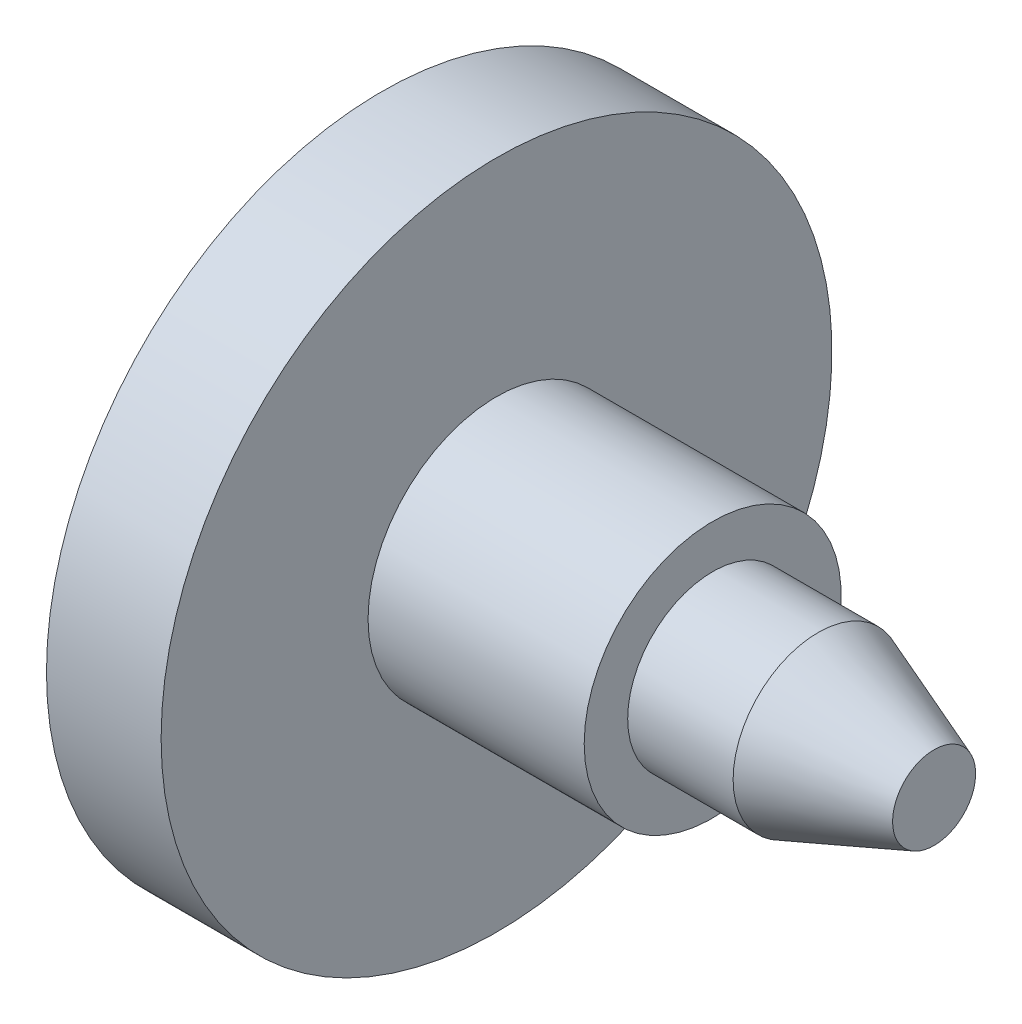
ISO-10303-21;
HEADER;
FILE_DESCRIPTION(('STEP AP214'),'2;1');
FILE_NAME('part.step','',(''),(''),'','','');
FILE_SCHEMA(('AUTOMOTIVE_DESIGN { 1 0 10303 214 1 1 1 1 }'));
ENDSEC;
DATA;
#1=APPLICATION_CONTEXT('core data for automotive mechanical design processes');
#2=APPLICATION_PROTOCOL_DEFINITION('international standard','automotive_design',2000,#1);
#3=PRODUCT_CONTEXT('',#1,'mechanical');
#4=PRODUCT('Part','Part','',(#3));
#5=PRODUCT_RELATED_PRODUCT_CATEGORY('part','',(#4));
#6=PRODUCT_DEFINITION_FORMATION('','',#4);
#7=PRODUCT_DEFINITION_CONTEXT('part definition',#1,'design');
#8=PRODUCT_DEFINITION('design','',#6,#7);
#9=PRODUCT_DEFINITION_SHAPE('','',#8);
#10=(LENGTH_UNIT() NAMED_UNIT(*) SI_UNIT(.MILLI.,.METRE.));
#11=(NAMED_UNIT(*) PLANE_ANGLE_UNIT() SI_UNIT($,.RADIAN.));
#12=(NAMED_UNIT(*) SI_UNIT($,.STERADIAN.) SOLID_ANGLE_UNIT());
#13=UNCERTAINTY_MEASURE_WITH_UNIT(LENGTH_MEASURE(1.E-05),#10,'distance_accuracy_value','');
#14=(GEOMETRIC_REPRESENTATION_CONTEXT(3) GLOBAL_UNCERTAINTY_ASSIGNED_CONTEXT((#13)) GLOBAL_UNIT_ASSIGNED_CONTEXT((#10,
#11,#12)) REPRESENTATION_CONTEXT('',''));
#15=CARTESIAN_POINT('',(0.,0.,0.));
#16=DIRECTION('',(0.,0.,1.));
#17=DIRECTION('',(1.,0.,0.));
#18=AXIS2_PLACEMENT_3D('',#15,#16,#17);
#19=CARTESIAN_POINT('',(-97.1655671494993,0.,0.));
#20=DIRECTION('',(-1.,0.,0.));
#21=DIRECTION('',(0.,0.,1.));
#22=AXIS2_PLACEMENT_3D('',#19,#20,#21);
#23=CYLINDRICAL_SURFACE('',#22,67.8443771356303);
#24=CARTESIAN_POINT('',(-23.1907994166224,0.,0.));
#25=DIRECTION('',(-1.,0.,0.));
#26=DIRECTION('',(0.,0.,1.));
#27=AXIS2_PLACEMENT_3D('',#24,#25,#26);
#28=CIRCLE('',#27,67.8443771356303);
#29=CARTESIAN_POINT('',(-23.1907994166224,0.,67.8443771356303));
#30=VERTEX_POINT('',#29);
#31=EDGE_CURVE('E10',#30,#30,#28,.T.);
#32=ORIENTED_EDGE('',*,*,#31,.F.);
#33=EDGE_LOOP('',(#32));
#34=FACE_BOUND('',#33,.T.);
#35=CARTESIAN_POINT('',(0.,0.,0.));
#36=DIRECTION('',(-1.,0.,0.));
#37=DIRECTION('',(0.,0.,1.));
#38=AXIS2_PLACEMENT_3D('',#35,#36,#37);
#39=CIRCLE('',#38,67.8443771356303);
#40=CARTESIAN_POINT('',(0.,0.,67.8443771356303));
#41=VERTEX_POINT('',#40);
#42=EDGE_CURVE('E77',#41,#41,#39,.T.);
#43=ORIENTED_EDGE('',*,*,#42,.T.);
#44=EDGE_LOOP('',(#43));
#45=FACE_BOUND('',#44,.T.);
#46=ADVANCED_FACE('F31',(#34,#45),#23,.T.);
#47=CARTESIAN_POINT('',(-23.1907994166224,67.8443771356303,0.));
#48=DIRECTION('',(1.,0.,0.));
#49=DIRECTION('',(0.,0.,-1.));
#50=AXIS2_PLACEMENT_3D('',#47,#48,#49);
#51=PLANE('',#50);
#52=CARTESIAN_POINT('',(-23.1907994166224,0.,0.));
#53=DIRECTION('',(-1.,0.,0.));
#54=DIRECTION('',(0.,0.,1.));
#55=AXIS2_PLACEMENT_3D('',#52,#53,#54);
#56=CIRCLE('',#55,35.588307849142);
#57=CARTESIAN_POINT('',(-23.1907994166224,0.,35.588307849142));
#58=VERTEX_POINT('',#57);
#59=EDGE_CURVE('E37',#58,#58,#56,.T.);
#60=ORIENTED_EDGE('',*,*,#59,.F.);
#61=EDGE_LOOP('',(#60));
#62=FACE_BOUND('',#61,.T.);
#63=ORIENTED_EDGE('',*,*,#31,.T.);
#64=EDGE_LOOP('',(#63));
#65=FACE_BOUND('',#64,.T.);
#66=ADVANCED_FACE('F123',(#62,#65),#51,.F.);
#67=CARTESIAN_POINT('',(-97.1655671494993,0.,0.));
#68=DIRECTION('',(-1.,0.,0.));
#69=DIRECTION('',(0.,0.,1.));
#70=AXIS2_PLACEMENT_3D('',#67,#68,#69);
#71=CYLINDRICAL_SURFACE('',#70,35.588307849142);
#72=CARTESIAN_POINT('',(-45.8516026221156,0.,0.));
#73=DIRECTION('',(-1.,0.,0.));
#74=DIRECTION('',(0.,0.,1.));
#75=AXIS2_PLACEMENT_3D('',#72,#73,#74);
#76=CIRCLE('',#75,35.588307849142);
#77=CARTESIAN_POINT('',(-45.8516026221156,0.,35.588307849142));
#78=VERTEX_POINT('',#77);
#79=EDGE_CURVE('E41',#78,#78,#76,.T.);
#80=ORIENTED_EDGE('',*,*,#79,.F.);
#81=EDGE_LOOP('',(#80));
#82=FACE_BOUND('',#81,.T.);
#83=ORIENTED_EDGE('',*,*,#59,.T.);
#84=EDGE_LOOP('',(#83));
#85=FACE_BOUND('',#84,.T.);
#86=ADVANCED_FACE('F128',(#82,#85),#71,.T.);
#87=CARTESIAN_POINT('',(-45.8516026221156,35.588307849142,0.));
#88=DIRECTION('',(1.,0.,0.));
#89=DIRECTION('',(0.,0.,-1.));
#90=AXIS2_PLACEMENT_3D('',#87,#88,#89);
#91=PLANE('',#90);
#92=CARTESIAN_POINT('',(-45.8516026221156,0.,0.));
#93=DIRECTION('',(-1.,0.,0.));
#94=DIRECTION('',(0.,0.,1.));
#95=AXIS2_PLACEMENT_3D('',#92,#93,#94);
#96=CIRCLE('',#95,25.9914607886992);
#97=CARTESIAN_POINT('',(-45.8516026221156,0.,25.9914607886992));
#98=VERTEX_POINT('',#97);
#99=EDGE_CURVE('E45',#98,#98,#96,.T.);
#100=ORIENTED_EDGE('',*,*,#99,.F.);
#101=EDGE_LOOP('',(#100));
#102=FACE_BOUND('',#101,.T.);
#103=ORIENTED_EDGE('',*,*,#79,.T.);
#104=EDGE_LOOP('',(#103));
#105=FACE_BOUND('',#104,.T.);
#106=ADVANCED_FACE('F133',(#102,#105),#91,.F.);
#107=CARTESIAN_POINT('',(-97.1655671494993,0.,0.));
#108=DIRECTION('',(-1.,0.,0.));
#109=DIRECTION('',(0.,0.,1.));
#110=AXIS2_PLACEMENT_3D('',#107,#108,#109);
#111=CYLINDRICAL_SURFACE('',#110,25.9914607886992);
#112=CARTESIAN_POINT('',(-29.8584385008252,0.,0.));
#113=DIRECTION('',(-1.,0.,0.));
#114=DIRECTION('',(0.,0.,1.));
#115=AXIS2_PLACEMENT_3D('',#112,#113,#114);
#116=CIRCLE('',#115,25.9914607886992);
#117=CARTESIAN_POINT('',(-29.8584385008252,0.,25.9914607886992));
#118=VERTEX_POINT('',#117);
#119=EDGE_CURVE('E50',#118,#118,#116,.T.);
#120=ORIENTED_EDGE('',*,*,#119,.F.);
#121=EDGE_LOOP('',(#120));
#122=FACE_BOUND('',#121,.T.);
#123=ORIENTED_EDGE('',*,*,#99,.T.);
#124=EDGE_LOOP('',(#123));
#125=FACE_BOUND('',#124,.T.);
#126=ADVANCED_FACE('F139',(#122,#125),#111,.F.);
#127=CARTESIAN_POINT('',(-29.8584385008252,25.9914607886992,0.));
#128=DIRECTION('',(1.,0.,0.));
#129=DIRECTION('',(0.,0.,-1.));
#130=AXIS2_PLACEMENT_3D('',#127,#128,#129);
#131=PLANE('',#130);
#132=CARTESIAN_POINT('',(-29.8584385008252,0.,0.));
#133=DIRECTION('',(-1.,0.,0.));
#134=DIRECTION('',(0.,0.,1.));
#135=AXIS2_PLACEMENT_3D('',#132,#133,#134);
#136=CIRCLE('',#135,11.3296111130227);
#137=CARTESIAN_POINT('',(-29.8584385008252,0.,11.3296111130227));
#138=VERTEX_POINT('',#137);
#139=EDGE_CURVE('E53',#138,#138,#136,.T.);
#140=ORIENTED_EDGE('',*,*,#139,.F.);
#141=EDGE_LOOP('',(#140));
#142=FACE_BOUND('',#141,.T.);
#143=ORIENTED_EDGE('',*,*,#119,.T.);
#144=EDGE_LOOP('',(#143));
#145=FACE_BOUND('',#144,.T.);
#146=ADVANCED_FACE('F143',(#142,#145),#131,.F.);
#147=CARTESIAN_POINT('',(-97.1655671494993,0.,0.));
#148=DIRECTION('',(-1.,0.,0.));
#149=DIRECTION('',(0.,0.,1.));
#150=AXIS2_PLACEMENT_3D('',#147,#148,#149);
#151=CYLINDRICAL_SURFACE('',#150,11.3296111130227);
#152=CARTESIAN_POINT('',(60.3904157970172,0.,0.));
#153=DIRECTION('',(-1.,0.,0.));
#154=DIRECTION('',(0.,0.,1.));
#155=AXIS2_PLACEMENT_3D('',#152,#153,#154);
#156=CIRCLE('',#155,11.3296111130227);
#157=CARTESIAN_POINT('',(60.3904157970172,0.,11.3296111130227));
#158=VERTEX_POINT('',#157);
#159=EDGE_CURVE('E56',#158,#158,#156,.T.);
#160=ORIENTED_EDGE('',*,*,#159,.F.);
#161=EDGE_LOOP('',(#160));
#162=FACE_BOUND('',#161,.T.);
#163=ORIENTED_EDGE('',*,*,#139,.T.);
#164=EDGE_LOOP('',(#163));
#165=FACE_BOUND('',#164,.T.);
#166=ADVANCED_FACE('F147',(#162,#165),#151,.F.);
#167=CARTESIAN_POINT('',(60.3904157970172,0.,0.));
#168=DIRECTION('',(-1.,0.,0.));
#169=DIRECTION('',(0.,0.,1.));
#170=AXIS2_PLACEMENT_3D('',#167,#168,#169);
#171=CONICAL_SURFACE('',#170,11.3296111130227,0.310925537461711);
#172=CARTESIAN_POINT('',(78.6408300786285,0.,0.));
#173=DIRECTION('',(-1.,0.,0.));
#174=DIRECTION('',(0.,0.,1.));
#175=AXIS2_PLACEMENT_3D('',#172,#173,#174);
#176=CIRCLE('',#175,5.46487124275214);
#177=CARTESIAN_POINT('',(78.6408300786285,0.,5.46487124275214));
#178=VERTEX_POINT('',#177);
#179=EDGE_CURVE('E59',#178,#178,#176,.T.);
#180=ORIENTED_EDGE('',*,*,#179,.F.);
#181=EDGE_LOOP('',(#180));
#182=FACE_BOUND('',#181,.T.);
#183=ORIENTED_EDGE('',*,*,#159,.T.);
#184=EDGE_LOOP('',(#183));
#185=FACE_BOUND('',#184,.T.);
#186=ADVANCED_FACE('F119',(#182,#185),#171,.F.);
#187=CARTESIAN_POINT('',(78.6408300786285,5.46487124275214,0.));
#188=DIRECTION('',(1.,0.,0.));
#189=DIRECTION('',(0.,0.,-1.));
#190=AXIS2_PLACEMENT_3D('',#187,#188,#189);
#191=PLANE('',#190);
#192=ORIENTED_EDGE('',*,*,#179,.T.);
#193=EDGE_LOOP('',(#192));
#194=FACE_BOUND('',#193,.T.);
#195=ADVANCED_FACE('F114',(#194),#191,.F.);
#196=CARTESIAN_POINT('',(88.5042562240836,0.,0.));
#197=DIRECTION('',(-1.,0.,0.));
#198=DIRECTION('',(0.,0.,1.));
#199=AXIS2_PLACEMENT_3D('',#196,#197,#198);
#200=PLANE('',#199);
#201=CARTESIAN_POINT('',(88.5042562240836,0.,0.));
#202=DIRECTION('',(-1.,0.,0.));
#203=DIRECTION('',(0.,0.,1.));
#204=AXIS2_PLACEMENT_3D('',#201,#202,#203);
#205=CIRCLE('',#204,8.39724117788746);
#206=CARTESIAN_POINT('',(88.5042562240836,0.,8.39724117788746));
#207=VERTEX_POINT('',#206);
#208=EDGE_CURVE('E62',#207,#207,#205,.T.);
#209=ORIENTED_EDGE('',*,*,#208,.F.);
#210=EDGE_LOOP('',(#209));
#211=FACE_BOUND('',#210,.T.);
#212=ADVANCED_FACE('F109',(#211),#200,.F.);
#213=CARTESIAN_POINT('',(88.5042562240836,0.,0.));
#214=DIRECTION('',(-1.,0.,0.));
#215=DIRECTION('',(0.,0.,1.));
#216=AXIS2_PLACEMENT_3D('',#213,#214,#215);
#217=CONICAL_SURFACE('',#216,8.39724117788746,0.358770670270572);
#218=CARTESIAN_POINT('',(65.0452967430012,0.,0.));
#219=DIRECTION('',(-1.,0.,0.));
#220=DIRECTION('',(0.,0.,1.));
#221=AXIS2_PLACEMENT_3D('',#218,#219,#220);
#222=CIRCLE('',#221,17.1943509832934);
#223=CARTESIAN_POINT('',(65.0452967430012,0.,17.1943509832934));
#224=VERTEX_POINT('',#223);
#225=EDGE_CURVE('E65',#224,#224,#222,.T.);
#226=ORIENTED_EDGE('',*,*,#225,.F.);
#227=EDGE_LOOP('',(#226));
#228=FACE_BOUND('',#227,.T.);
#229=ORIENTED_EDGE('',*,*,#208,.T.);
#230=EDGE_LOOP('',(#229));
#231=FACE_BOUND('',#230,.T.);
#232=ADVANCED_FACE('F103',(#228,#231),#217,.T.);
#233=CARTESIAN_POINT('',(-97.1655671494993,0.,0.));
#234=DIRECTION('',(-1.,0.,0.));
#235=DIRECTION('',(0.,0.,1.));
#236=AXIS2_PLACEMENT_3D('',#233,#234,#235);
#237=CYLINDRICAL_SURFACE('',#236,17.1943509832934);
#238=CARTESIAN_POINT('',(43.7189699420172,0.,0.));
#239=DIRECTION('',(-1.,0.,0.));
#240=DIRECTION('',(0.,0.,1.));
#241=AXIS2_PLACEMENT_3D('',#238,#239,#240);
#242=CIRCLE('',#241,17.1943509832934);
#243=CARTESIAN_POINT('',(43.7189699420172,0.,17.1943509832934));
#244=VERTEX_POINT('',#243);
#245=EDGE_CURVE('E68',#244,#244,#242,.T.);
#246=ORIENTED_EDGE('',*,*,#245,.F.);
#247=EDGE_LOOP('',(#246));
#248=FACE_BOUND('',#247,.T.);
#249=ORIENTED_EDGE('',*,*,#225,.T.);
#250=EDGE_LOOP('',(#249));
#251=FACE_BOUND('',#250,.T.);
#252=ADVANCED_FACE('F97',(#248,#251),#237,.T.);
#253=CARTESIAN_POINT('',(43.7189699420172,25.9914607886993,0.));
#254=DIRECTION('',(-1.,0.,0.));
#255=DIRECTION('',(0.,0.,1.));
#256=AXIS2_PLACEMENT_3D('',#253,#254,#255);
#257=PLANE('',#256);
#258=CARTESIAN_POINT('',(43.7189699420172,0.,0.));
#259=DIRECTION('',(-1.,0.,0.));
#260=DIRECTION('',(0.,0.,1.));
#261=AXIS2_PLACEMENT_3D('',#258,#259,#260);
#262=CIRCLE('',#261,25.9914607886993);
#263=CARTESIAN_POINT('',(43.7189699420172,0.,25.9914607886993));
#264=VERTEX_POINT('',#263);
#265=EDGE_CURVE('E71',#264,#264,#262,.T.);
#266=ORIENTED_EDGE('',*,*,#265,.F.);
#267=EDGE_LOOP('',(#266));
#268=FACE_BOUND('',#267,.T.);
#269=ORIENTED_EDGE('',*,*,#245,.T.);
#270=EDGE_LOOP('',(#269));
#271=FACE_BOUND('',#270,.T.);
#272=ADVANCED_FACE('F91',(#268,#271),#257,.F.);
#273=CARTESIAN_POINT('',(-97.1655671494993,0.,0.));
#274=DIRECTION('',(-1.,0.,0.));
#275=DIRECTION('',(0.,0.,1.));
#276=AXIS2_PLACEMENT_3D('',#273,#274,#275);
#277=CYLINDRICAL_SURFACE('',#276,25.9914607886993);
#278=CARTESIAN_POINT('',(0.,0.,0.));
#279=DIRECTION('',(-1.,0.,0.));
#280=DIRECTION('',(0.,0.,1.));
#281=AXIS2_PLACEMENT_3D('',#278,#279,#280);
#282=CIRCLE('',#281,25.9914607886993);
#283=CARTESIAN_POINT('',(0.,0.,25.9914607886993));
#284=VERTEX_POINT('',#283);
#285=EDGE_CURVE('E74',#284,#284,#282,.T.);
#286=ORIENTED_EDGE('',*,*,#285,.F.);
#287=EDGE_LOOP('',(#286));
#288=FACE_BOUND('',#287,.T.);
#289=ORIENTED_EDGE('',*,*,#265,.T.);
#290=EDGE_LOOP('',(#289));
#291=FACE_BOUND('',#290,.T.);
#292=ADVANCED_FACE('F85',(#288,#291),#277,.T.);
#293=CARTESIAN_POINT('',(0.,67.8443771356303,0.));
#294=DIRECTION('',(-1.,0.,0.));
#295=DIRECTION('',(0.,0.,1.));
#296=AXIS2_PLACEMENT_3D('',#293,#294,#295);
#297=PLANE('',#296);
#298=ORIENTED_EDGE('',*,*,#42,.F.);
#299=EDGE_LOOP('',(#298));
#300=FACE_BOUND('',#299,.T.);
#301=ORIENTED_EDGE('',*,*,#285,.T.);
#302=EDGE_LOOP('',(#301));
#303=FACE_BOUND('',#302,.T.);
#304=ADVANCED_FACE('F82',(#300,#303),#297,.F.);
#305=CLOSED_SHELL('',(#46,#66,#86,#106,#126,#146,#166,#186,#195,#212,#232,#252,#272,#292,#304));
#306=MANIFOLD_SOLID_BREP('B2',#305);
#307=ADVANCED_BREP_SHAPE_REPRESENTATION('',(#18,#306),#14);
#308=SHAPE_DEFINITION_REPRESENTATION(#9,#307);
ENDSEC;
END-ISO-10303-21;
